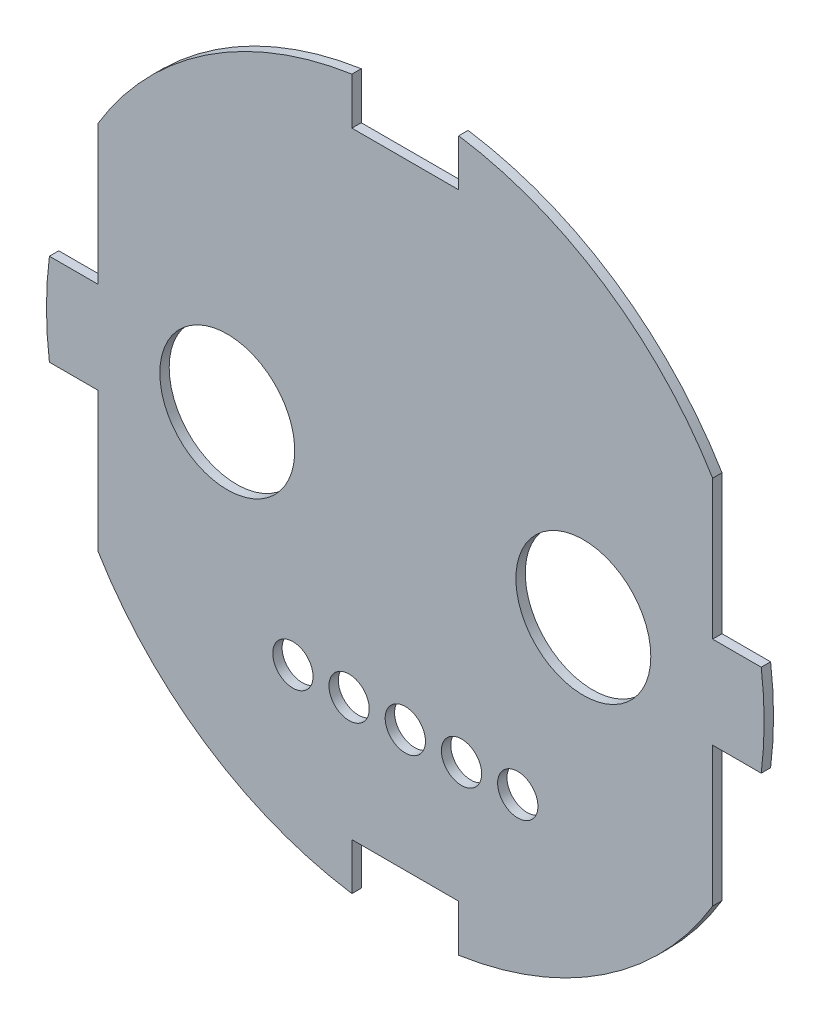
ISO-10303-21;
HEADER;
FILE_DESCRIPTION(('STEP AP214'),'2;1');
FILE_NAME('part.step','',(''),(''),'','','');
FILE_SCHEMA(('AUTOMOTIVE_DESIGN { 1 0 10303 214 1 1 1 1 }'));
ENDSEC;
DATA;
#1=APPLICATION_CONTEXT('core data for automotive mechanical design processes');
#2=APPLICATION_PROTOCOL_DEFINITION('international standard','automotive_design',2000,#1);
#3=PRODUCT_CONTEXT('',#1,'mechanical');
#4=PRODUCT('Part','Part','',(#3));
#5=PRODUCT_RELATED_PRODUCT_CATEGORY('part','',(#4));
#6=PRODUCT_DEFINITION_FORMATION('','',#4);
#7=PRODUCT_DEFINITION_CONTEXT('part definition',#1,'design');
#8=PRODUCT_DEFINITION('design','',#6,#7);
#9=PRODUCT_DEFINITION_SHAPE('','',#8);
#10=(LENGTH_UNIT() NAMED_UNIT(*) SI_UNIT(.MILLI.,.METRE.));
#11=(NAMED_UNIT(*) PLANE_ANGLE_UNIT() SI_UNIT($,.RADIAN.));
#12=(NAMED_UNIT(*) SI_UNIT($,.STERADIAN.) SOLID_ANGLE_UNIT());
#13=UNCERTAINTY_MEASURE_WITH_UNIT(LENGTH_MEASURE(1.E-05),#10,'distance_accuracy_value','');
#14=(GEOMETRIC_REPRESENTATION_CONTEXT(3) GLOBAL_UNCERTAINTY_ASSIGNED_CONTEXT((#13)) GLOBAL_UNIT_ASSIGNED_CONTEXT((#10,
#11,#12)) REPRESENTATION_CONTEXT('',''));
#15=CARTESIAN_POINT('',(0.,0.,0.));
#16=DIRECTION('',(0.,0.,1.));
#17=DIRECTION('',(1.,0.,0.));
#18=AXIS2_PLACEMENT_3D('',#15,#16,#17);
#19=CARTESIAN_POINT('',(0.,0.,0.5));
#20=DIRECTION('',(0.,0.,1.));
#21=DIRECTION('',(1.,0.,0.));
#22=AXIS2_PLACEMENT_3D('',#19,#20,#21);
#23=PLANE('',#22);
#24=CARTESIAN_POINT('',(-6.00000000000001,-9.93907960581376,0.5));
#25=DIRECTION('',(0.,0.,1.));
#26=DIRECTION('',(1.,0.,0.));
#27=AXIS2_PLACEMENT_3D('',#24,#25,#26);
#28=CIRCLE('',#27,1.075);
#29=CARTESIAN_POINT('',(-4.92500000000001,-9.93907960581376,0.5));
#30=VERTEX_POINT('',#29);
#31=EDGE_CURVE('E2304',#30,#30,#28,.T.);
#32=ORIENTED_EDGE('',*,*,#31,.F.);
#33=EDGE_LOOP('',(#32));
#34=FACE_BOUND('',#33,.T.);
#35=CARTESIAN_POINT('',(-3.,-9.93907960581375,0.5));
#36=DIRECTION('',(0.,0.,1.));
#37=DIRECTION('',(1.,0.,0.));
#38=AXIS2_PLACEMENT_3D('',#35,#36,#37);
#39=CIRCLE('',#38,1.075);
#40=CARTESIAN_POINT('',(-1.925,-9.93907960581375,0.5));
#41=VERTEX_POINT('',#40);
#42=EDGE_CURVE('E2298',#41,#41,#39,.T.);
#43=ORIENTED_EDGE('',*,*,#42,.F.);
#44=EDGE_LOOP('',(#43));
#45=FACE_BOUND('',#44,.T.);
#46=CARTESIAN_POINT('',(6.00000000000001,-9.93907960581372,0.5));
#47=DIRECTION('',(0.,0.,1.));
#48=DIRECTION('',(1.,0.,0.));
#49=AXIS2_PLACEMENT_3D('',#46,#47,#48);
#50=CIRCLE('',#49,1.075);
#51=CARTESIAN_POINT('',(7.075,-9.93907960581372,0.5));
#52=VERTEX_POINT('',#51);
#53=EDGE_CURVE('E2292',#52,#52,#50,.T.);
#54=ORIENTED_EDGE('',*,*,#53,.F.);
#55=EDGE_LOOP('',(#54));
#56=FACE_BOUND('',#55,.T.);
#57=CARTESIAN_POINT('',(3.,-9.93907960581372,0.5));
#58=DIRECTION('',(0.,0.,1.));
#59=DIRECTION('',(1.,0.,0.));
#60=AXIS2_PLACEMENT_3D('',#57,#58,#59);
#61=CIRCLE('',#60,1.075);
#62=CARTESIAN_POINT('',(4.075,-9.93907960581372,0.5));
#63=VERTEX_POINT('',#62);
#64=EDGE_CURVE('E2286',#63,#63,#61,.T.);
#65=ORIENTED_EDGE('',*,*,#64,.F.);
#66=EDGE_LOOP('',(#65));
#67=FACE_BOUND('',#66,.T.);
#68=CARTESIAN_POINT('',(-9.50000000000001,0.,0.5));
#69=DIRECTION('',(0.,0.,-1.));
#70=DIRECTION('',(-1.,0.,0.));
#71=AXIS2_PLACEMENT_3D('',#68,#69,#70);
#72=CIRCLE('',#71,3.60000000000001);
#73=CARTESIAN_POINT('',(-13.1,0.,0.5));
#74=VERTEX_POINT('',#73);
#75=EDGE_CURVE('E2280',#74,#74,#72,.F.);
#76=ORIENTED_EDGE('',*,*,#75,.F.);
#77=EDGE_LOOP('',(#76));
#78=FACE_BOUND('',#77,.T.);
#79=CARTESIAN_POINT('',(0.,-9.93907960581372,0.5));
#80=DIRECTION('',(0.,0.,1.));
#81=DIRECTION('',(1.,0.,0.));
#82=AXIS2_PLACEMENT_3D('',#79,#80,#81);
#83=CIRCLE('',#82,1.075);
#84=CARTESIAN_POINT('',(1.075,-9.93907960581372,0.5));
#85=VERTEX_POINT('',#84);
#86=EDGE_CURVE('E2274',#85,#85,#83,.T.);
#87=ORIENTED_EDGE('',*,*,#86,.F.);
#88=EDGE_LOOP('',(#87));
#89=FACE_BOUND('',#88,.T.);
#90=CARTESIAN_POINT('',(9.50000000000001,0.,0.5));
#91=DIRECTION('',(0.,0.,1.));
#92=DIRECTION('',(1.,0.,0.));
#93=AXIS2_PLACEMENT_3D('',#90,#91,#92);
#94=CIRCLE('',#93,3.60000000000001);
#95=CARTESIAN_POINT('',(13.1,0.,0.5));
#96=VERTEX_POINT('',#95);
#97=EDGE_CURVE('E2268',#96,#96,#94,.T.);
#98=ORIENTED_EDGE('',*,*,#97,.F.);
#99=EDGE_LOOP('',(#98));
#100=FACE_BOUND('',#99,.T.);
#101=DIRECTION('',(0.,1.,0.));
#102=VECTOR('',#101,1.);
#103=CARTESIAN_POINT('',(-2.85,-16.7890796058137,0.5));
#104=LINE('',#103,#102);
#105=CARTESIAN_POINT('',(-2.85,-18.9367367833003,0.5));
#106=VERTEX_POINT('',#105);
#107=CARTESIAN_POINT('',(-2.85,-16.4390796058137,0.5));
#108=VERTEX_POINT('',#107);
#109=EDGE_CURVE('E2222',#106,#108,#104,.T.);
#110=ORIENTED_EDGE('',*,*,#109,.T.);
#111=DIRECTION('',(1.,0.,0.));
#112=VECTOR('',#111,1.);
#113=CARTESIAN_POINT('',(-2.5,-16.4390796058137,0.5));
#114=LINE('',#113,#112);
#115=CARTESIAN_POINT('',(2.85,-16.4390796058137,0.5));
#116=VERTEX_POINT('',#115);
#117=EDGE_CURVE('E2168',#108,#116,#114,.T.);
#118=ORIENTED_EDGE('',*,*,#117,.T.);
#119=DIRECTION('',(0.,-1.,0.));
#120=VECTOR('',#119,1.);
#121=CARTESIAN_POINT('',(2.85,-16.7890796058137,0.5));
#122=LINE('',#121,#120);
#123=CARTESIAN_POINT('',(2.85,-18.9367367833003,0.5));
#124=VERTEX_POINT('',#123);
#125=EDGE_CURVE('E2171',#116,#124,#122,.T.);
#126=ORIENTED_EDGE('',*,*,#125,.T.);
#127=CARTESIAN_POINT('',(0.,0.,0.5));
#128=DIRECTION('',(0.,0.,1.));
#129=DIRECTION('',(1.,0.,0.));
#130=AXIS2_PLACEMENT_3D('',#127,#128,#129);
#131=CIRCLE('',#130,19.15);
#132=CARTESIAN_POINT('',(16.4,-9.88749209860622,0.5));
#133=VERTEX_POINT('',#132);
#134=EDGE_CURVE('E1976',#124,#133,#131,.T.);
#135=ORIENTED_EDGE('',*,*,#134,.T.);
#136=DIRECTION('',(0.,1.,0.));
#137=VECTOR('',#136,1.);
#138=CARTESIAN_POINT('',(16.4,-2.8,0.5));
#139=LINE('',#138,#137);
#140=CARTESIAN_POINT('',(16.4,-2.45,0.5));
#141=VERTEX_POINT('',#140);
#142=EDGE_CURVE('E2104',#133,#141,#139,.T.);
#143=ORIENTED_EDGE('',*,*,#142,.T.);
#144=DIRECTION('',(1.,0.,0.));
#145=VECTOR('',#144,1.);
#146=CARTESIAN_POINT('',(19.2979273498477,-2.45,0.5));
#147=LINE('',#146,#145);
#148=CARTESIAN_POINT('',(18.9926301496133,-2.45,0.5));
#149=VERTEX_POINT('',#148);
#150=EDGE_CURVE('E2177',#141,#149,#147,.T.);
#151=ORIENTED_EDGE('',*,*,#150,.T.);
#152=CARTESIAN_POINT('',(0.,0.,0.5));
#153=DIRECTION('',(0.,0.,1.));
#154=DIRECTION('',(1.,0.,0.));
#155=AXIS2_PLACEMENT_3D('',#152,#153,#154);
#156=CIRCLE('',#155,19.15);
#157=CARTESIAN_POINT('',(18.9926301496133,2.45,0.5));
#158=VERTEX_POINT('',#157);
#159=EDGE_CURVE('E2180',#149,#158,#156,.T.);
#160=ORIENTED_EDGE('',*,*,#159,.T.);
#161=DIRECTION('',(-1.,0.,0.));
#162=VECTOR('',#161,1.);
#163=CARTESIAN_POINT('',(19.2979273498477,2.45,0.5));
#164=LINE('',#163,#162);
#165=CARTESIAN_POINT('',(16.4,2.45,0.5));
#166=VERTEX_POINT('',#165);
#167=EDGE_CURVE('E2183',#158,#166,#164,.T.);
#168=ORIENTED_EDGE('',*,*,#167,.T.);
#169=DIRECTION('',(0.,1.,0.));
#170=VECTOR('',#169,1.);
#171=CARTESIAN_POINT('',(16.4,2.8,0.5));
#172=LINE('',#171,#170);
#173=CARTESIAN_POINT('',(16.4,9.88749209860623,0.5));
#174=VERTEX_POINT('',#173);
#175=EDGE_CURVE('E2186',#166,#174,#172,.T.);
#176=ORIENTED_EDGE('',*,*,#175,.T.);
#177=CARTESIAN_POINT('',(0.,0.,0.5));
#178=DIRECTION('',(0.,0.,1.));
#179=DIRECTION('',(1.,0.,0.));
#180=AXIS2_PLACEMENT_3D('',#177,#178,#179);
#181=CIRCLE('',#180,19.15);
#182=CARTESIAN_POINT('',(2.85,18.9367367833003,0.5));
#183=VERTEX_POINT('',#182);
#184=EDGE_CURVE('E2189',#174,#183,#181,.T.);
#185=ORIENTED_EDGE('',*,*,#184,.T.);
#186=DIRECTION('',(0.,-1.,0.));
#187=VECTOR('',#186,1.);
#188=CARTESIAN_POINT('',(2.85,16.7890796058137,0.5));
#189=LINE('',#188,#187);
#190=CARTESIAN_POINT('',(2.85,16.4390796058137,0.5));
#191=VERTEX_POINT('',#190);
#192=EDGE_CURVE('E2192',#183,#191,#189,.T.);
#193=ORIENTED_EDGE('',*,*,#192,.T.);
#194=DIRECTION('',(-1.,0.,0.));
#195=VECTOR('',#194,1.);
#196=CARTESIAN_POINT('',(-2.5,16.4390796058137,0.5));
#197=LINE('',#196,#195);
#198=CARTESIAN_POINT('',(-2.85,16.4390796058137,0.5));
#199=VERTEX_POINT('',#198);
#200=EDGE_CURVE('E2195',#191,#199,#197,.T.);
#201=ORIENTED_EDGE('',*,*,#200,.T.);
#202=DIRECTION('',(0.,1.,0.));
#203=VECTOR('',#202,1.);
#204=CARTESIAN_POINT('',(-2.85,16.7890796058137,0.5));
#205=LINE('',#204,#203);
#206=CARTESIAN_POINT('',(-2.85,18.9367367833003,0.5));
#207=VERTEX_POINT('',#206);
#208=EDGE_CURVE('E2198',#199,#207,#205,.T.);
#209=ORIENTED_EDGE('',*,*,#208,.T.);
#210=CARTESIAN_POINT('',(0.,0.,0.5));
#211=DIRECTION('',(0.,0.,1.));
#212=DIRECTION('',(1.,0.,0.));
#213=AXIS2_PLACEMENT_3D('',#210,#211,#212);
#214=CIRCLE('',#213,19.15);
#215=CARTESIAN_POINT('',(-16.4,9.88749209860623,0.5));
#216=VERTEX_POINT('',#215);
#217=EDGE_CURVE('E2201',#207,#216,#214,.T.);
#218=ORIENTED_EDGE('',*,*,#217,.T.);
#219=DIRECTION('',(0.,-1.,0.));
#220=VECTOR('',#219,1.);
#221=CARTESIAN_POINT('',(-16.4,2.8,0.5));
#222=LINE('',#221,#220);
#223=CARTESIAN_POINT('',(-16.4,2.45,0.5));
#224=VERTEX_POINT('',#223);
#225=EDGE_CURVE('E2204',#216,#224,#222,.T.);
#226=ORIENTED_EDGE('',*,*,#225,.T.);
#227=DIRECTION('',(-1.,0.,0.));
#228=VECTOR('',#227,1.);
#229=CARTESIAN_POINT('',(-19.2979273498477,2.45,0.5));
#230=LINE('',#229,#228);
#231=CARTESIAN_POINT('',(-18.9926301496133,2.45,0.5));
#232=VERTEX_POINT('',#231);
#233=EDGE_CURVE('E2207',#224,#232,#230,.T.);
#234=ORIENTED_EDGE('',*,*,#233,.T.);
#235=CARTESIAN_POINT('',(0.,0.,0.5));
#236=DIRECTION('',(0.,0.,1.));
#237=DIRECTION('',(1.,0.,0.));
#238=AXIS2_PLACEMENT_3D('',#235,#236,#237);
#239=CIRCLE('',#238,19.15);
#240=CARTESIAN_POINT('',(-18.9926301496133,-2.45,0.5));
#241=VERTEX_POINT('',#240);
#242=EDGE_CURVE('E2210',#232,#241,#239,.T.);
#243=ORIENTED_EDGE('',*,*,#242,.T.);
#244=DIRECTION('',(1.,0.,0.));
#245=VECTOR('',#244,1.);
#246=CARTESIAN_POINT('',(-19.2979273498477,-2.45,0.5));
#247=LINE('',#246,#245);
#248=CARTESIAN_POINT('',(-16.4,-2.45,0.5));
#249=VERTEX_POINT('',#248);
#250=EDGE_CURVE('E2213',#241,#249,#247,.T.);
#251=ORIENTED_EDGE('',*,*,#250,.T.);
#252=DIRECTION('',(0.,-1.,0.));
#253=VECTOR('',#252,1.);
#254=CARTESIAN_POINT('',(-16.4,-2.8,0.5));
#255=LINE('',#254,#253);
#256=CARTESIAN_POINT('',(-16.4,-9.88749209860622,0.5));
#257=VERTEX_POINT('',#256);
#258=EDGE_CURVE('E2216',#249,#257,#255,.T.);
#259=ORIENTED_EDGE('',*,*,#258,.T.);
#260=CARTESIAN_POINT('',(0.,0.,0.5));
#261=DIRECTION('',(0.,0.,1.));
#262=DIRECTION('',(1.,0.,0.));
#263=AXIS2_PLACEMENT_3D('',#260,#261,#262);
#264=CIRCLE('',#263,19.15);
#265=EDGE_CURVE('E2219',#257,#106,#264,.T.);
#266=ORIENTED_EDGE('',*,*,#265,.T.);
#267=EDGE_LOOP('',(#110,#118,#126,#135,#143,#151,#160,#168,#176,#185,#193,#201,#209,#218,#226,
#234,#243,#251,#259,#266));
#268=FACE_BOUND('',#267,.T.);
#269=ADVANCED_FACE('F1959',(#34,#45,#56,#67,#78,#89,#100,#268),#23,.T.);
#270=CARTESIAN_POINT('',(0.,0.,0.));
#271=DIRECTION('',(0.,0.,1.));
#272=DIRECTION('',(1.,0.,0.));
#273=AXIS2_PLACEMENT_3D('',#270,#271,#272);
#274=PLANE('',#273);
#275=CARTESIAN_POINT('',(-6.00000000000001,-9.93907960581376,0.));
#276=DIRECTION('',(0.,0.,1.));
#277=DIRECTION('',(1.,0.,0.));
#278=AXIS2_PLACEMENT_3D('',#275,#276,#277);
#279=CIRCLE('',#278,1.075);
#280=CARTESIAN_POINT('',(-4.92500000000001,-9.93907960581376,0.));
#281=VERTEX_POINT('',#280);
#282=EDGE_CURVE('E2301',#281,#281,#279,.T.);
#283=ORIENTED_EDGE('',*,*,#282,.T.);
#284=EDGE_LOOP('',(#283));
#285=FACE_BOUND('',#284,.T.);
#286=CARTESIAN_POINT('',(-3.,-9.93907960581375,0.));
#287=DIRECTION('',(0.,0.,1.));
#288=DIRECTION('',(1.,0.,0.));
#289=AXIS2_PLACEMENT_3D('',#286,#287,#288);
#290=CIRCLE('',#289,1.075);
#291=CARTESIAN_POINT('',(-1.925,-9.93907960581375,0.));
#292=VERTEX_POINT('',#291);
#293=EDGE_CURVE('E2295',#292,#292,#290,.T.);
#294=ORIENTED_EDGE('',*,*,#293,.T.);
#295=EDGE_LOOP('',(#294));
#296=FACE_BOUND('',#295,.T.);
#297=CARTESIAN_POINT('',(6.00000000000001,-9.93907960581372,0.));
#298=DIRECTION('',(0.,0.,1.));
#299=DIRECTION('',(1.,0.,0.));
#300=AXIS2_PLACEMENT_3D('',#297,#298,#299);
#301=CIRCLE('',#300,1.075);
#302=CARTESIAN_POINT('',(7.075,-9.93907960581372,0.));
#303=VERTEX_POINT('',#302);
#304=EDGE_CURVE('E2289',#303,#303,#301,.T.);
#305=ORIENTED_EDGE('',*,*,#304,.T.);
#306=EDGE_LOOP('',(#305));
#307=FACE_BOUND('',#306,.T.);
#308=CARTESIAN_POINT('',(3.,-9.93907960581372,0.));
#309=DIRECTION('',(0.,0.,1.));
#310=DIRECTION('',(1.,0.,0.));
#311=AXIS2_PLACEMENT_3D('',#308,#309,#310);
#312=CIRCLE('',#311,1.075);
#313=CARTESIAN_POINT('',(4.075,-9.93907960581372,0.));
#314=VERTEX_POINT('',#313);
#315=EDGE_CURVE('E2283',#314,#314,#312,.T.);
#316=ORIENTED_EDGE('',*,*,#315,.T.);
#317=EDGE_LOOP('',(#316));
#318=FACE_BOUND('',#317,.T.);
#319=CARTESIAN_POINT('',(-9.50000000000001,0.,0.));
#320=DIRECTION('',(0.,0.,-1.));
#321=DIRECTION('',(-1.,0.,0.));
#322=AXIS2_PLACEMENT_3D('',#319,#320,#321);
#323=CIRCLE('',#322,3.60000000000001);
#324=CARTESIAN_POINT('',(-13.1,0.,0.));
#325=VERTEX_POINT('',#324);
#326=EDGE_CURVE('E2277',#325,#325,#323,.F.);
#327=ORIENTED_EDGE('',*,*,#326,.T.);
#328=EDGE_LOOP('',(#327));
#329=FACE_BOUND('',#328,.T.);
#330=CARTESIAN_POINT('',(0.,-9.93907960581372,0.));
#331=DIRECTION('',(0.,0.,1.));
#332=DIRECTION('',(1.,0.,0.));
#333=AXIS2_PLACEMENT_3D('',#330,#331,#332);
#334=CIRCLE('',#333,1.075);
#335=CARTESIAN_POINT('',(1.075,-9.93907960581372,0.));
#336=VERTEX_POINT('',#335);
#337=EDGE_CURVE('E2271',#336,#336,#334,.T.);
#338=ORIENTED_EDGE('',*,*,#337,.T.);
#339=EDGE_LOOP('',(#338));
#340=FACE_BOUND('',#339,.T.);
#341=CARTESIAN_POINT('',(9.50000000000001,0.,0.));
#342=DIRECTION('',(0.,0.,1.));
#343=DIRECTION('',(1.,0.,0.));
#344=AXIS2_PLACEMENT_3D('',#341,#342,#343);
#345=CIRCLE('',#344,3.60000000000001);
#346=CARTESIAN_POINT('',(13.1,0.,0.));
#347=VERTEX_POINT('',#346);
#348=EDGE_CURVE('E2172',#347,#347,#345,.T.);
#349=ORIENTED_EDGE('',*,*,#348,.T.);
#350=EDGE_LOOP('',(#349));
#351=FACE_BOUND('',#350,.T.);
#352=DIRECTION('',(1.,0.,0.));
#353=VECTOR('',#352,1.);
#354=CARTESIAN_POINT('',(-2.5,-16.4390796058137,0.));
#355=LINE('',#354,#353);
#356=CARTESIAN_POINT('',(-2.85,-16.4390796058137,0.));
#357=VERTEX_POINT('',#356);
#358=CARTESIAN_POINT('',(2.85,-16.4390796058137,0.));
#359=VERTEX_POINT('',#358);
#360=EDGE_CURVE('E1984',#357,#359,#355,.T.);
#361=ORIENTED_EDGE('',*,*,#360,.F.);
#362=DIRECTION('',(0.,1.,0.));
#363=VECTOR('',#362,1.);
#364=CARTESIAN_POINT('',(-2.85,-16.7890796058137,0.));
#365=LINE('',#364,#363);
#366=CARTESIAN_POINT('',(-2.85,-18.9367367833003,0.));
#367=VERTEX_POINT('',#366);
#368=EDGE_CURVE('E2165',#367,#357,#365,.T.);
#369=ORIENTED_EDGE('',*,*,#368,.F.);
#370=CARTESIAN_POINT('',(0.,0.,0.));
#371=DIRECTION('',(0.,0.,1.));
#372=DIRECTION('',(1.,0.,0.));
#373=AXIS2_PLACEMENT_3D('',#370,#371,#372);
#374=CIRCLE('',#373,19.15);
#375=CARTESIAN_POINT('',(-16.4,-9.88749209860622,0.));
#376=VERTEX_POINT('',#375);
#377=EDGE_CURVE('E2162',#376,#367,#374,.T.);
#378=ORIENTED_EDGE('',*,*,#377,.F.);
#379=DIRECTION('',(0.,-1.,0.));
#380=VECTOR('',#379,1.);
#381=CARTESIAN_POINT('',(-16.4,-2.8,0.));
#382=LINE('',#381,#380);
#383=CARTESIAN_POINT('',(-16.4,-2.45,0.));
#384=VERTEX_POINT('',#383);
#385=EDGE_CURVE('E2159',#384,#376,#382,.T.);
#386=ORIENTED_EDGE('',*,*,#385,.F.);
#387=DIRECTION('',(1.,0.,0.));
#388=VECTOR('',#387,1.);
#389=CARTESIAN_POINT('',(-19.2979273498477,-2.45,0.));
#390=LINE('',#389,#388);
#391=CARTESIAN_POINT('',(-18.9926301496133,-2.45,0.));
#392=VERTEX_POINT('',#391);
#393=EDGE_CURVE('E2156',#392,#384,#390,.T.);
#394=ORIENTED_EDGE('',*,*,#393,.F.);
#395=CARTESIAN_POINT('',(0.,0.,0.));
#396=DIRECTION('',(0.,0.,1.));
#397=DIRECTION('',(1.,0.,0.));
#398=AXIS2_PLACEMENT_3D('',#395,#396,#397);
#399=CIRCLE('',#398,19.15);
#400=CARTESIAN_POINT('',(-18.9926301496133,2.45,0.));
#401=VERTEX_POINT('',#400);
#402=EDGE_CURVE('E2153',#401,#392,#399,.T.);
#403=ORIENTED_EDGE('',*,*,#402,.F.);
#404=DIRECTION('',(-1.,0.,0.));
#405=VECTOR('',#404,1.);
#406=CARTESIAN_POINT('',(-19.2979273498477,2.45,0.));
#407=LINE('',#406,#405);
#408=CARTESIAN_POINT('',(-16.4,2.45,0.));
#409=VERTEX_POINT('',#408);
#410=EDGE_CURVE('E2150',#409,#401,#407,.T.);
#411=ORIENTED_EDGE('',*,*,#410,.F.);
#412=DIRECTION('',(0.,-1.,0.));
#413=VECTOR('',#412,1.);
#414=CARTESIAN_POINT('',(-16.4,2.8,0.));
#415=LINE('',#414,#413);
#416=CARTESIAN_POINT('',(-16.4,9.88749209860623,0.));
#417=VERTEX_POINT('',#416);
#418=EDGE_CURVE('E2147',#417,#409,#415,.T.);
#419=ORIENTED_EDGE('',*,*,#418,.F.);
#420=CARTESIAN_POINT('',(0.,0.,0.));
#421=DIRECTION('',(0.,0.,1.));
#422=DIRECTION('',(1.,0.,0.));
#423=AXIS2_PLACEMENT_3D('',#420,#421,#422);
#424=CIRCLE('',#423,19.15);
#425=CARTESIAN_POINT('',(-2.85,18.9367367833003,0.));
#426=VERTEX_POINT('',#425);
#427=EDGE_CURVE('E2144',#426,#417,#424,.T.);
#428=ORIENTED_EDGE('',*,*,#427,.F.);
#429=DIRECTION('',(0.,1.,0.));
#430=VECTOR('',#429,1.);
#431=CARTESIAN_POINT('',(-2.85,16.7890796058137,0.));
#432=LINE('',#431,#430);
#433=CARTESIAN_POINT('',(-2.85,16.4390796058137,0.));
#434=VERTEX_POINT('',#433);
#435=EDGE_CURVE('E2141',#434,#426,#432,.T.);
#436=ORIENTED_EDGE('',*,*,#435,.F.);
#437=DIRECTION('',(-1.,0.,0.));
#438=VECTOR('',#437,1.);
#439=CARTESIAN_POINT('',(-2.5,16.4390796058137,0.));
#440=LINE('',#439,#438);
#441=CARTESIAN_POINT('',(2.85,16.4390796058137,0.));
#442=VERTEX_POINT('',#441);
#443=EDGE_CURVE('E2138',#442,#434,#440,.T.);
#444=ORIENTED_EDGE('',*,*,#443,.F.);
#445=DIRECTION('',(0.,-1.,0.));
#446=VECTOR('',#445,1.);
#447=CARTESIAN_POINT('',(2.85,16.7890796058137,0.));
#448=LINE('',#447,#446);
#449=CARTESIAN_POINT('',(2.85,18.9367367833003,0.));
#450=VERTEX_POINT('',#449);
#451=EDGE_CURVE('E2135',#450,#442,#448,.T.);
#452=ORIENTED_EDGE('',*,*,#451,.F.);
#453=CARTESIAN_POINT('',(0.,0.,0.));
#454=DIRECTION('',(0.,0.,1.));
#455=DIRECTION('',(1.,0.,0.));
#456=AXIS2_PLACEMENT_3D('',#453,#454,#455);
#457=CIRCLE('',#456,19.15);
#458=CARTESIAN_POINT('',(16.4,9.88749209860623,0.));
#459=VERTEX_POINT('',#458);
#460=EDGE_CURVE('E2132',#459,#450,#457,.T.);
#461=ORIENTED_EDGE('',*,*,#460,.F.);
#462=DIRECTION('',(0.,1.,0.));
#463=VECTOR('',#462,1.);
#464=CARTESIAN_POINT('',(16.4,2.8,0.));
#465=LINE('',#464,#463);
#466=CARTESIAN_POINT('',(16.4,2.45,0.));
#467=VERTEX_POINT('',#466);
#468=EDGE_CURVE('E2129',#467,#459,#465,.T.);
#469=ORIENTED_EDGE('',*,*,#468,.F.);
#470=DIRECTION('',(-1.,0.,0.));
#471=VECTOR('',#470,1.);
#472=CARTESIAN_POINT('',(19.2979273498477,2.45,0.));
#473=LINE('',#472,#471);
#474=CARTESIAN_POINT('',(18.9926301496133,2.45,0.));
#475=VERTEX_POINT('',#474);
#476=EDGE_CURVE('E2126',#475,#467,#473,.T.);
#477=ORIENTED_EDGE('',*,*,#476,.F.);
#478=CARTESIAN_POINT('',(0.,0.,0.));
#479=DIRECTION('',(0.,0.,1.));
#480=DIRECTION('',(1.,0.,0.));
#481=AXIS2_PLACEMENT_3D('',#478,#479,#480);
#482=CIRCLE('',#481,19.15);
#483=CARTESIAN_POINT('',(18.9926301496133,-2.45,0.));
#484=VERTEX_POINT('',#483);
#485=EDGE_CURVE('E2120',#484,#475,#482,.T.);
#486=ORIENTED_EDGE('',*,*,#485,.F.);
#487=DIRECTION('',(1.,0.,0.));
#488=VECTOR('',#487,1.);
#489=CARTESIAN_POINT('',(19.2979273498477,-2.45,0.));
#490=LINE('',#489,#488);
#491=CARTESIAN_POINT('',(16.4,-2.45,0.));
#492=VERTEX_POINT('',#491);
#493=EDGE_CURVE('E2118',#492,#484,#490,.T.);
#494=ORIENTED_EDGE('',*,*,#493,.F.);
#495=DIRECTION('',(0.,1.,0.));
#496=VECTOR('',#495,1.);
#497=CARTESIAN_POINT('',(16.4,-2.8,0.));
#498=LINE('',#497,#496);
#499=CARTESIAN_POINT('',(16.4,-9.88749209860622,0.));
#500=VERTEX_POINT('',#499);
#501=EDGE_CURVE('E2101',#500,#492,#498,.T.);
#502=ORIENTED_EDGE('',*,*,#501,.F.);
#503=CARTESIAN_POINT('',(0.,0.,0.));
#504=DIRECTION('',(0.,0.,1.));
#505=DIRECTION('',(1.,0.,0.));
#506=AXIS2_PLACEMENT_3D('',#503,#504,#505);
#507=CIRCLE('',#506,19.15);
#508=CARTESIAN_POINT('',(2.85,-18.9367367833003,0.));
#509=VERTEX_POINT('',#508);
#510=EDGE_CURVE('E2109',#509,#500,#507,.T.);
#511=ORIENTED_EDGE('',*,*,#510,.F.);
#512=DIRECTION('',(0.,-1.,0.));
#513=VECTOR('',#512,1.);
#514=CARTESIAN_POINT('',(2.85,-16.7890796058137,0.));
#515=LINE('',#514,#513);
#516=EDGE_CURVE('E2114',#359,#509,#515,.T.);
#517=ORIENTED_EDGE('',*,*,#516,.F.);
#518=EDGE_LOOP('',(#361,#369,#378,#386,#394,#403,#411,#419,#428,#436,#444,#452,#461,#469,#477,
#486,#494,#502,#511,#517));
#519=FACE_BOUND('',#518,.T.);
#520=ADVANCED_FACE('F1961',(#285,#296,#307,#318,#329,#340,#351,#519),#274,.F.);
#521=CARTESIAN_POINT('',(-2.5,-16.4390796058137,0.));
#522=DIRECTION('',(0.,-1.,0.));
#523=DIRECTION('',(0.,0.,-1.));
#524=AXIS2_PLACEMENT_3D('',#521,#522,#523);
#525=PLANE('',#524);
#526=ORIENTED_EDGE('',*,*,#117,.F.);
#527=DIRECTION('',(0.,0.,1.));
#528=VECTOR('',#527,1.);
#529=CARTESIAN_POINT('',(-2.85,-16.4390796058137,0.));
#530=LINE('',#529,#528);
#531=EDGE_CURVE('E12',#357,#108,#530,.T.);
#532=ORIENTED_EDGE('',*,*,#531,.F.);
#533=ORIENTED_EDGE('',*,*,#360,.T.);
#534=DIRECTION('',(0.,0.,1.));
#535=VECTOR('',#534,1.);
#536=CARTESIAN_POINT('',(2.85,-16.4390796058137,0.));
#537=LINE('',#536,#535);
#538=EDGE_CURVE('E1963',#359,#116,#537,.T.);
#539=ORIENTED_EDGE('',*,*,#538,.T.);
#540=EDGE_LOOP('',(#526,#532,#533,#539));
#541=FACE_BOUND('',#540,.T.);
#542=ADVANCED_FACE('F2257',(#541),#525,.T.);
#543=CARTESIAN_POINT('',(-2.85,-16.7890796058137,0.));
#544=DIRECTION('',(1.,0.,0.));
#545=DIRECTION('',(0.,0.,-1.));
#546=AXIS2_PLACEMENT_3D('',#543,#544,#545);
#547=PLANE('',#546);
#548=ORIENTED_EDGE('',*,*,#109,.F.);
#549=DIRECTION('',(0.,0.,1.));
#550=VECTOR('',#549,1.);
#551=CARTESIAN_POINT('',(-2.85,-18.9367367833003,0.));
#552=LINE('',#551,#550);
#553=EDGE_CURVE('E1968',#367,#106,#552,.T.);
#554=ORIENTED_EDGE('',*,*,#553,.F.);
#555=ORIENTED_EDGE('',*,*,#368,.T.);
#556=ORIENTED_EDGE('',*,*,#531,.T.);
#557=EDGE_LOOP('',(#548,#554,#555,#556));
#558=FACE_BOUND('',#557,.T.);
#559=ADVANCED_FACE('F2263',(#558),#547,.T.);
#560=CARTESIAN_POINT('',(0.,0.,0.));
#561=DIRECTION('',(0.,0.,1.));
#562=DIRECTION('',(1.,0.,0.));
#563=AXIS2_PLACEMENT_3D('',#560,#561,#562);
#564=CYLINDRICAL_SURFACE('',#563,19.15);
#565=ORIENTED_EDGE('',*,*,#265,.F.);
#566=DIRECTION('',(0.,0.,1.));
#567=VECTOR('',#566,1.);
#568=CARTESIAN_POINT('',(-16.4,-9.88749209860622,0.));
#569=LINE('',#568,#567);
#570=EDGE_CURVE('E2226',#376,#257,#569,.T.);
#571=ORIENTED_EDGE('',*,*,#570,.F.);
#572=ORIENTED_EDGE('',*,*,#377,.T.);
#573=ORIENTED_EDGE('',*,*,#553,.T.);
#574=EDGE_LOOP('',(#565,#571,#572,#573));
#575=FACE_BOUND('',#574,.T.);
#576=ADVANCED_FACE('F2351',(#575),#564,.T.);
#577=CARTESIAN_POINT('',(-16.4,-2.8,0.));
#578=DIRECTION('',(-1.,0.,0.));
#579=DIRECTION('',(0.,0.,1.));
#580=AXIS2_PLACEMENT_3D('',#577,#578,#579);
#581=PLANE('',#580);
#582=ORIENTED_EDGE('',*,*,#258,.F.);
#583=DIRECTION('',(0.,0.,1.));
#584=VECTOR('',#583,1.);
#585=CARTESIAN_POINT('',(-16.4,-2.45,0.));
#586=LINE('',#585,#584);
#587=EDGE_CURVE('E2228',#384,#249,#586,.T.);
#588=ORIENTED_EDGE('',*,*,#587,.F.);
#589=ORIENTED_EDGE('',*,*,#385,.T.);
#590=ORIENTED_EDGE('',*,*,#570,.T.);
#591=EDGE_LOOP('',(#582,#588,#589,#590));
#592=FACE_BOUND('',#591,.T.);
#593=ADVANCED_FACE('F2354',(#592),#581,.T.);
#594=CARTESIAN_POINT('',(-19.2979273498477,-2.45,0.));
#595=DIRECTION('',(0.,-1.,0.));
#596=DIRECTION('',(0.,0.,-1.));
#597=AXIS2_PLACEMENT_3D('',#594,#595,#596);
#598=PLANE('',#597);
#599=ORIENTED_EDGE('',*,*,#250,.F.);
#600=DIRECTION('',(0.,0.,1.));
#601=VECTOR('',#600,1.);
#602=CARTESIAN_POINT('',(-18.9926301496133,-2.45,0.));
#603=LINE('',#602,#601);
#604=EDGE_CURVE('E2230',#392,#241,#603,.T.);
#605=ORIENTED_EDGE('',*,*,#604,.F.);
#606=ORIENTED_EDGE('',*,*,#393,.T.);
#607=ORIENTED_EDGE('',*,*,#587,.T.);
#608=EDGE_LOOP('',(#599,#605,#606,#607));
#609=FACE_BOUND('',#608,.T.);
#610=ADVANCED_FACE('F2358',(#609),#598,.T.);
#611=CARTESIAN_POINT('',(0.,0.,0.));
#612=DIRECTION('',(0.,0.,1.));
#613=DIRECTION('',(1.,0.,0.));
#614=AXIS2_PLACEMENT_3D('',#611,#612,#613);
#615=CYLINDRICAL_SURFACE('',#614,19.15);
#616=ORIENTED_EDGE('',*,*,#242,.F.);
#617=DIRECTION('',(0.,0.,1.));
#618=VECTOR('',#617,1.);
#619=CARTESIAN_POINT('',(-18.9926301496133,2.45,0.));
#620=LINE('',#619,#618);
#621=EDGE_CURVE('E2232',#401,#232,#620,.T.);
#622=ORIENTED_EDGE('',*,*,#621,.F.);
#623=ORIENTED_EDGE('',*,*,#402,.T.);
#624=ORIENTED_EDGE('',*,*,#604,.T.);
#625=EDGE_LOOP('',(#616,#622,#623,#624));
#626=FACE_BOUND('',#625,.T.);
#627=ADVANCED_FACE('F2362',(#626),#615,.T.);
#628=CARTESIAN_POINT('',(-19.2979273498477,2.45,0.));
#629=DIRECTION('',(0.,1.,0.));
#630=DIRECTION('',(0.,0.,1.));
#631=AXIS2_PLACEMENT_3D('',#628,#629,#630);
#632=PLANE('',#631);
#633=ORIENTED_EDGE('',*,*,#233,.F.);
#634=DIRECTION('',(0.,0.,1.));
#635=VECTOR('',#634,1.);
#636=CARTESIAN_POINT('',(-16.4,2.45,0.));
#637=LINE('',#636,#635);
#638=EDGE_CURVE('E2234',#409,#224,#637,.T.);
#639=ORIENTED_EDGE('',*,*,#638,.F.);
#640=ORIENTED_EDGE('',*,*,#410,.T.);
#641=ORIENTED_EDGE('',*,*,#621,.T.);
#642=EDGE_LOOP('',(#633,#639,#640,#641));
#643=FACE_BOUND('',#642,.T.);
#644=ADVANCED_FACE('F2366',(#643),#632,.T.);
#645=CARTESIAN_POINT('',(-16.4,2.8,0.));
#646=DIRECTION('',(-1.,0.,0.));
#647=DIRECTION('',(0.,0.,1.));
#648=AXIS2_PLACEMENT_3D('',#645,#646,#647);
#649=PLANE('',#648);
#650=ORIENTED_EDGE('',*,*,#225,.F.);
#651=DIRECTION('',(0.,0.,1.));
#652=VECTOR('',#651,1.);
#653=CARTESIAN_POINT('',(-16.4,9.88749209860623,0.));
#654=LINE('',#653,#652);
#655=EDGE_CURVE('E2236',#417,#216,#654,.T.);
#656=ORIENTED_EDGE('',*,*,#655,.F.);
#657=ORIENTED_EDGE('',*,*,#418,.T.);
#658=ORIENTED_EDGE('',*,*,#638,.T.);
#659=EDGE_LOOP('',(#650,#656,#657,#658));
#660=FACE_BOUND('',#659,.T.);
#661=ADVANCED_FACE('F2370',(#660),#649,.T.);
#662=CARTESIAN_POINT('',(0.,0.,0.));
#663=DIRECTION('',(0.,0.,1.));
#664=DIRECTION('',(1.,0.,0.));
#665=AXIS2_PLACEMENT_3D('',#662,#663,#664);
#666=CYLINDRICAL_SURFACE('',#665,19.15);
#667=ORIENTED_EDGE('',*,*,#217,.F.);
#668=DIRECTION('',(0.,0.,1.));
#669=VECTOR('',#668,1.);
#670=CARTESIAN_POINT('',(-2.85,18.9367367833003,0.));
#671=LINE('',#670,#669);
#672=EDGE_CURVE('E2238',#426,#207,#671,.T.);
#673=ORIENTED_EDGE('',*,*,#672,.F.);
#674=ORIENTED_EDGE('',*,*,#427,.T.);
#675=ORIENTED_EDGE('',*,*,#655,.T.);
#676=EDGE_LOOP('',(#667,#673,#674,#675));
#677=FACE_BOUND('',#676,.T.);
#678=ADVANCED_FACE('F2374',(#677),#666,.T.);
#679=CARTESIAN_POINT('',(-2.85,16.7890796058137,0.));
#680=DIRECTION('',(1.,0.,0.));
#681=DIRECTION('',(0.,0.,-1.));
#682=AXIS2_PLACEMENT_3D('',#679,#680,#681);
#683=PLANE('',#682);
#684=ORIENTED_EDGE('',*,*,#208,.F.);
#685=DIRECTION('',(0.,0.,1.));
#686=VECTOR('',#685,1.);
#687=CARTESIAN_POINT('',(-2.85,16.4390796058137,0.));
#688=LINE('',#687,#686);
#689=EDGE_CURVE('E2240',#434,#199,#688,.T.);
#690=ORIENTED_EDGE('',*,*,#689,.F.);
#691=ORIENTED_EDGE('',*,*,#435,.T.);
#692=ORIENTED_EDGE('',*,*,#672,.T.);
#693=EDGE_LOOP('',(#684,#690,#691,#692));
#694=FACE_BOUND('',#693,.T.);
#695=ADVANCED_FACE('F2378',(#694),#683,.T.);
#696=CARTESIAN_POINT('',(-2.5,16.4390796058137,0.));
#697=DIRECTION('',(0.,1.,0.));
#698=DIRECTION('',(0.,0.,1.));
#699=AXIS2_PLACEMENT_3D('',#696,#697,#698);
#700=PLANE('',#699);
#701=ORIENTED_EDGE('',*,*,#200,.F.);
#702=DIRECTION('',(0.,0.,1.));
#703=VECTOR('',#702,1.);
#704=CARTESIAN_POINT('',(2.85,16.4390796058137,0.));
#705=LINE('',#704,#703);
#706=EDGE_CURVE('E2242',#442,#191,#705,.T.);
#707=ORIENTED_EDGE('',*,*,#706,.F.);
#708=ORIENTED_EDGE('',*,*,#443,.T.);
#709=ORIENTED_EDGE('',*,*,#689,.T.);
#710=EDGE_LOOP('',(#701,#707,#708,#709));
#711=FACE_BOUND('',#710,.T.);
#712=ADVANCED_FACE('F2382',(#711),#700,.T.);
#713=CARTESIAN_POINT('',(2.85,16.7890796058137,0.));
#714=DIRECTION('',(-1.,0.,0.));
#715=DIRECTION('',(0.,0.,1.));
#716=AXIS2_PLACEMENT_3D('',#713,#714,#715);
#717=PLANE('',#716);
#718=ORIENTED_EDGE('',*,*,#192,.F.);
#719=DIRECTION('',(0.,0.,1.));
#720=VECTOR('',#719,1.);
#721=CARTESIAN_POINT('',(2.85,18.9367367833003,0.));
#722=LINE('',#721,#720);
#723=EDGE_CURVE('E2244',#450,#183,#722,.T.);
#724=ORIENTED_EDGE('',*,*,#723,.F.);
#725=ORIENTED_EDGE('',*,*,#451,.T.);
#726=ORIENTED_EDGE('',*,*,#706,.T.);
#727=EDGE_LOOP('',(#718,#724,#725,#726));
#728=FACE_BOUND('',#727,.T.);
#729=ADVANCED_FACE('F2386',(#728),#717,.T.);
#730=CARTESIAN_POINT('',(0.,0.,0.));
#731=DIRECTION('',(0.,0.,1.));
#732=DIRECTION('',(1.,0.,0.));
#733=AXIS2_PLACEMENT_3D('',#730,#731,#732);
#734=CYLINDRICAL_SURFACE('',#733,19.15);
#735=ORIENTED_EDGE('',*,*,#184,.F.);
#736=DIRECTION('',(0.,0.,1.));
#737=VECTOR('',#736,1.);
#738=CARTESIAN_POINT('',(16.4,9.88749209860623,0.));
#739=LINE('',#738,#737);
#740=EDGE_CURVE('E2246',#459,#174,#739,.T.);
#741=ORIENTED_EDGE('',*,*,#740,.F.);
#742=ORIENTED_EDGE('',*,*,#460,.T.);
#743=ORIENTED_EDGE('',*,*,#723,.T.);
#744=EDGE_LOOP('',(#735,#741,#742,#743));
#745=FACE_BOUND('',#744,.T.);
#746=ADVANCED_FACE('F2390',(#745),#734,.T.);
#747=CARTESIAN_POINT('',(16.4,2.8,0.));
#748=DIRECTION('',(1.,0.,0.));
#749=DIRECTION('',(0.,0.,-1.));
#750=AXIS2_PLACEMENT_3D('',#747,#748,#749);
#751=PLANE('',#750);
#752=ORIENTED_EDGE('',*,*,#175,.F.);
#753=DIRECTION('',(0.,0.,1.));
#754=VECTOR('',#753,1.);
#755=CARTESIAN_POINT('',(16.4,2.45,0.));
#756=LINE('',#755,#754);
#757=EDGE_CURVE('E2248',#467,#166,#756,.T.);
#758=ORIENTED_EDGE('',*,*,#757,.F.);
#759=ORIENTED_EDGE('',*,*,#468,.T.);
#760=ORIENTED_EDGE('',*,*,#740,.T.);
#761=EDGE_LOOP('',(#752,#758,#759,#760));
#762=FACE_BOUND('',#761,.T.);
#763=ADVANCED_FACE('F2394',(#762),#751,.T.);
#764=CARTESIAN_POINT('',(19.2979273498477,2.45,0.));
#765=DIRECTION('',(0.,1.,0.));
#766=DIRECTION('',(0.,0.,1.));
#767=AXIS2_PLACEMENT_3D('',#764,#765,#766);
#768=PLANE('',#767);
#769=ORIENTED_EDGE('',*,*,#167,.F.);
#770=DIRECTION('',(0.,0.,1.));
#771=VECTOR('',#770,1.);
#772=CARTESIAN_POINT('',(18.9926301496133,2.45,0.));
#773=LINE('',#772,#771);
#774=EDGE_CURVE('E2250',#475,#158,#773,.T.);
#775=ORIENTED_EDGE('',*,*,#774,.F.);
#776=ORIENTED_EDGE('',*,*,#476,.T.);
#777=ORIENTED_EDGE('',*,*,#757,.T.);
#778=EDGE_LOOP('',(#769,#775,#776,#777));
#779=FACE_BOUND('',#778,.T.);
#780=ADVANCED_FACE('F2398',(#779),#768,.T.);
#781=CARTESIAN_POINT('',(0.,0.,0.));
#782=DIRECTION('',(0.,0.,1.));
#783=DIRECTION('',(1.,0.,0.));
#784=AXIS2_PLACEMENT_3D('',#781,#782,#783);
#785=CYLINDRICAL_SURFACE('',#784,19.15);
#786=ORIENTED_EDGE('',*,*,#159,.F.);
#787=DIRECTION('',(0.,0.,1.));
#788=VECTOR('',#787,1.);
#789=CARTESIAN_POINT('',(18.9926301496133,-2.45,0.));
#790=LINE('',#789,#788);
#791=EDGE_CURVE('E2252',#484,#149,#790,.T.);
#792=ORIENTED_EDGE('',*,*,#791,.F.);
#793=ORIENTED_EDGE('',*,*,#485,.T.);
#794=ORIENTED_EDGE('',*,*,#774,.T.);
#795=EDGE_LOOP('',(#786,#792,#793,#794));
#796=FACE_BOUND('',#795,.T.);
#797=ADVANCED_FACE('F2402',(#796),#785,.T.);
#798=CARTESIAN_POINT('',(19.2979273498477,-2.45,0.));
#799=DIRECTION('',(0.,-1.,0.));
#800=DIRECTION('',(0.,0.,-1.));
#801=AXIS2_PLACEMENT_3D('',#798,#799,#800);
#802=PLANE('',#801);
#803=ORIENTED_EDGE('',*,*,#150,.F.);
#804=DIRECTION('',(0.,0.,1.));
#805=VECTOR('',#804,1.);
#806=CARTESIAN_POINT('',(16.4,-2.45,0.));
#807=LINE('',#806,#805);
#808=EDGE_CURVE('E2105',#492,#141,#807,.T.);
#809=ORIENTED_EDGE('',*,*,#808,.F.);
#810=ORIENTED_EDGE('',*,*,#493,.T.);
#811=ORIENTED_EDGE('',*,*,#791,.T.);
#812=EDGE_LOOP('',(#803,#809,#810,#811));
#813=FACE_BOUND('',#812,.T.);
#814=ADVANCED_FACE('F2406',(#813),#802,.T.);
#815=CARTESIAN_POINT('',(16.4,-2.8,0.));
#816=DIRECTION('',(1.,0.,0.));
#817=DIRECTION('',(0.,0.,-1.));
#818=AXIS2_PLACEMENT_3D('',#815,#816,#817);
#819=PLANE('',#818);
#820=ORIENTED_EDGE('',*,*,#142,.F.);
#821=DIRECTION('',(0.,0.,1.));
#822=VECTOR('',#821,1.);
#823=CARTESIAN_POINT('',(16.4,-9.88749209860622,0.));
#824=LINE('',#823,#822);
#825=EDGE_CURVE('E2097',#500,#133,#824,.T.);
#826=ORIENTED_EDGE('',*,*,#825,.F.);
#827=ORIENTED_EDGE('',*,*,#501,.T.);
#828=ORIENTED_EDGE('',*,*,#808,.T.);
#829=EDGE_LOOP('',(#820,#826,#827,#828));
#830=FACE_BOUND('',#829,.T.);
#831=ADVANCED_FACE('F2099',(#830),#819,.T.);
#832=CARTESIAN_POINT('',(0.,0.,0.));
#833=DIRECTION('',(0.,0.,1.));
#834=DIRECTION('',(1.,0.,0.));
#835=AXIS2_PLACEMENT_3D('',#832,#833,#834);
#836=CYLINDRICAL_SURFACE('',#835,19.15);
#837=ORIENTED_EDGE('',*,*,#134,.F.);
#838=DIRECTION('',(0.,0.,1.));
#839=VECTOR('',#838,1.);
#840=CARTESIAN_POINT('',(2.85,-18.9367367833003,0.));
#841=LINE('',#840,#839);
#842=EDGE_CURVE('E2106',#509,#124,#841,.T.);
#843=ORIENTED_EDGE('',*,*,#842,.F.);
#844=ORIENTED_EDGE('',*,*,#510,.T.);
#845=ORIENTED_EDGE('',*,*,#825,.T.);
#846=EDGE_LOOP('',(#837,#843,#844,#845));
#847=FACE_BOUND('',#846,.T.);
#848=ADVANCED_FACE('F2110',(#847),#836,.T.);
#849=CARTESIAN_POINT('',(2.85,-16.7890796058137,0.));
#850=DIRECTION('',(-1.,0.,0.));
#851=DIRECTION('',(0.,0.,1.));
#852=AXIS2_PLACEMENT_3D('',#849,#850,#851);
#853=PLANE('',#852);
#854=ORIENTED_EDGE('',*,*,#125,.F.);
#855=ORIENTED_EDGE('',*,*,#538,.F.);
#856=ORIENTED_EDGE('',*,*,#516,.T.);
#857=ORIENTED_EDGE('',*,*,#842,.T.);
#858=EDGE_LOOP('',(#854,#855,#856,#857));
#859=FACE_BOUND('',#858,.T.);
#860=ADVANCED_FACE('F2258',(#859),#853,.T.);
#861=CARTESIAN_POINT('',(9.50000000000001,0.,0.));
#862=DIRECTION('',(0.,0.,1.));
#863=DIRECTION('',(1.,0.,0.));
#864=AXIS2_PLACEMENT_3D('',#861,#862,#863);
#865=CYLINDRICAL_SURFACE('',#864,3.60000000000001);
#866=ORIENTED_EDGE('',*,*,#348,.F.);
#867=EDGE_LOOP('',(#866));
#868=FACE_BOUND('',#867,.T.);
#869=ORIENTED_EDGE('',*,*,#97,.T.);
#870=EDGE_LOOP('',(#869));
#871=FACE_BOUND('',#870,.T.);
#872=ADVANCED_FACE('F2333',(#868,#871),#865,.F.);
#873=CARTESIAN_POINT('',(0.,-9.93907960581372,0.));
#874=DIRECTION('',(0.,0.,1.));
#875=DIRECTION('',(1.,0.,0.));
#876=AXIS2_PLACEMENT_3D('',#873,#874,#875);
#877=CYLINDRICAL_SURFACE('',#876,1.075);
#878=ORIENTED_EDGE('',*,*,#337,.F.);
#879=EDGE_LOOP('',(#878));
#880=FACE_BOUND('',#879,.T.);
#881=ORIENTED_EDGE('',*,*,#86,.T.);
#882=EDGE_LOOP('',(#881));
#883=FACE_BOUND('',#882,.T.);
#884=ADVANCED_FACE('F2335',(#880,#883),#877,.F.);
#885=CARTESIAN_POINT('',(-9.50000000000001,0.,0.));
#886=DIRECTION('',(0.,0.,1.));
#887=DIRECTION('',(1.,0.,0.));
#888=AXIS2_PLACEMENT_3D('',#885,#886,#887);
#889=CYLINDRICAL_SURFACE('',#888,3.60000000000001);
#890=ORIENTED_EDGE('',*,*,#326,.F.);
#891=EDGE_LOOP('',(#890));
#892=FACE_BOUND('',#891,.T.);
#893=ORIENTED_EDGE('',*,*,#75,.T.);
#894=EDGE_LOOP('',(#893));
#895=FACE_BOUND('',#894,.T.);
#896=ADVANCED_FACE('F2342',(#892,#895),#889,.F.);
#897=CARTESIAN_POINT('',(3.,-9.93907960581372,0.));
#898=DIRECTION('',(0.,0.,1.));
#899=DIRECTION('',(1.,0.,0.));
#900=AXIS2_PLACEMENT_3D('',#897,#898,#899);
#901=CYLINDRICAL_SURFACE('',#900,1.075);
#902=ORIENTED_EDGE('',*,*,#315,.F.);
#903=EDGE_LOOP('',(#902));
#904=FACE_BOUND('',#903,.T.);
#905=ORIENTED_EDGE('',*,*,#64,.T.);
#906=EDGE_LOOP('',(#905));
#907=FACE_BOUND('',#906,.T.);
#908=ADVANCED_FACE('F2545',(#904,#907),#901,.F.);
#909=CARTESIAN_POINT('',(6.00000000000001,-9.93907960581372,0.));
#910=DIRECTION('',(0.,0.,1.));
#911=DIRECTION('',(1.,0.,0.));
#912=AXIS2_PLACEMENT_3D('',#909,#910,#911);
#913=CYLINDRICAL_SURFACE('',#912,1.075);
#914=ORIENTED_EDGE('',*,*,#304,.F.);
#915=EDGE_LOOP('',(#914));
#916=FACE_BOUND('',#915,.T.);
#917=ORIENTED_EDGE('',*,*,#53,.T.);
#918=EDGE_LOOP('',(#917));
#919=FACE_BOUND('',#918,.T.);
#920=ADVANCED_FACE('F2553',(#916,#919),#913,.F.);
#921=CARTESIAN_POINT('',(-3.,-9.93907960581375,0.));
#922=DIRECTION('',(0.,0.,1.));
#923=DIRECTION('',(1.,0.,0.));
#924=AXIS2_PLACEMENT_3D('',#921,#922,#923);
#925=CYLINDRICAL_SURFACE('',#924,1.075);
#926=ORIENTED_EDGE('',*,*,#293,.F.);
#927=EDGE_LOOP('',(#926));
#928=FACE_BOUND('',#927,.T.);
#929=ORIENTED_EDGE('',*,*,#42,.T.);
#930=EDGE_LOOP('',(#929));
#931=FACE_BOUND('',#930,.T.);
#932=ADVANCED_FACE('F2315',(#928,#931),#925,.F.);
#933=CARTESIAN_POINT('',(-6.00000000000001,-9.93907960581376,0.));
#934=DIRECTION('',(0.,0.,1.));
#935=DIRECTION('',(1.,0.,0.));
#936=AXIS2_PLACEMENT_3D('',#933,#934,#935);
#937=CYLINDRICAL_SURFACE('',#936,1.075);
#938=ORIENTED_EDGE('',*,*,#282,.F.);
#939=EDGE_LOOP('',(#938));
#940=FACE_BOUND('',#939,.T.);
#941=ORIENTED_EDGE('',*,*,#31,.T.);
#942=EDGE_LOOP('',(#941));
#943=FACE_BOUND('',#942,.T.);
#944=ADVANCED_FACE('F2312',(#940,#943),#937,.F.);
#945=CLOSED_SHELL('',(#269,#520,#542,#559,#576,#593,#610,#627,#644,#661,#678,#695,#712,#729,
#746,#763,#780,#797,#814,#831,#848,#860,#872,#884,#896,#908,#920,#932,#944));
#946=MANIFOLD_SOLID_BREP('B2',#945);
#947=ADVANCED_BREP_SHAPE_REPRESENTATION('',(#18,#946),#14);
#948=SHAPE_DEFINITION_REPRESENTATION(#9,#947);
ENDSEC;
END-ISO-10303-21;
